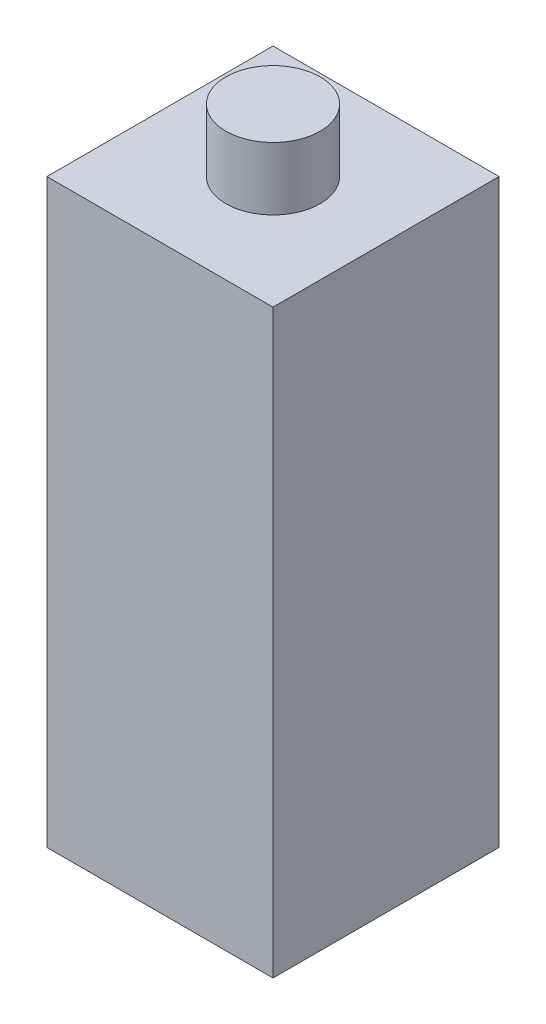
ISO-10303-21;
HEADER;
FILE_DESCRIPTION(('STEP AP214'),'2;1');
FILE_NAME('part.step','',(''),(''),'','','');
FILE_SCHEMA(('AUTOMOTIVE_DESIGN { 1 0 10303 214 1 1 1 1 }'));
ENDSEC;
DATA;
#1=APPLICATION_CONTEXT('core data for automotive mechanical design processes');
#2=APPLICATION_PROTOCOL_DEFINITION('international standard','automotive_design',2000,#1);
#3=PRODUCT_CONTEXT('',#1,'mechanical');
#4=PRODUCT('Part','Part','',(#3));
#5=PRODUCT_RELATED_PRODUCT_CATEGORY('part','',(#4));
#6=PRODUCT_DEFINITION_FORMATION('','',#4);
#7=PRODUCT_DEFINITION_CONTEXT('part definition',#1,'design');
#8=PRODUCT_DEFINITION('design','',#6,#7);
#9=PRODUCT_DEFINITION_SHAPE('','',#8);
#10=(LENGTH_UNIT() NAMED_UNIT(*) SI_UNIT(.MILLI.,.METRE.));
#11=(NAMED_UNIT(*) PLANE_ANGLE_UNIT() SI_UNIT($,.RADIAN.));
#12=(NAMED_UNIT(*) SI_UNIT($,.STERADIAN.) SOLID_ANGLE_UNIT());
#13=UNCERTAINTY_MEASURE_WITH_UNIT(LENGTH_MEASURE(1.E-05),#10,'distance_accuracy_value','');
#14=(GEOMETRIC_REPRESENTATION_CONTEXT(3) GLOBAL_UNCERTAINTY_ASSIGNED_CONTEXT((#13)) GLOBAL_UNIT_ASSIGNED_CONTEXT((#10,
#11,#12)) REPRESENTATION_CONTEXT('',''));
#15=CARTESIAN_POINT('',(0.,0.,0.));
#16=DIRECTION('',(0.,0.,1.));
#17=DIRECTION('',(1.,0.,0.));
#18=AXIS2_PLACEMENT_3D('',#15,#16,#17);
#19=CARTESIAN_POINT('',(36.,185.,-36.));
#20=DIRECTION('',(-1.,0.,0.));
#21=DIRECTION('',(0.,0.,1.));
#22=AXIS2_PLACEMENT_3D('',#19,#20,#21);
#23=PLANE('',#22);
#24=DIRECTION('',(0.,0.,-1.));
#25=VECTOR('',#24,1.);
#26=CARTESIAN_POINT('',(36.,0.,-36.));
#27=LINE('',#26,#25);
#28=CARTESIAN_POINT('',(36.,0.,36.));
#29=VERTEX_POINT('',#28);
#30=CARTESIAN_POINT('',(36.,0.,-36.));
#31=VERTEX_POINT('',#30);
#32=EDGE_CURVE('E112',#29,#31,#27,.T.);
#33=ORIENTED_EDGE('',*,*,#32,.T.);
#34=DIRECTION('',(0.,-1.,0.));
#35=VECTOR('',#34,1.);
#36=CARTESIAN_POINT('',(36.,185.,-36.));
#37=LINE('',#36,#35);
#38=CARTESIAN_POINT('',(36.,185.,-36.));
#39=VERTEX_POINT('',#38);
#40=EDGE_CURVE('E49',#39,#31,#37,.T.);
#41=ORIENTED_EDGE('',*,*,#40,.F.);
#42=DIRECTION('',(0.,0.,-1.));
#43=VECTOR('',#42,1.);
#44=CARTESIAN_POINT('',(36.,185.,-36.));
#45=LINE('',#44,#43);
#46=CARTESIAN_POINT('',(36.,185.,36.));
#47=VERTEX_POINT('',#46);
#48=EDGE_CURVE('E94',#47,#39,#45,.T.);
#49=ORIENTED_EDGE('',*,*,#48,.F.);
#50=DIRECTION('',(0.,-1.,0.));
#51=VECTOR('',#50,1.);
#52=CARTESIAN_POINT('',(36.,185.,36.));
#53=LINE('',#52,#51);
#54=EDGE_CURVE('E108',#47,#29,#53,.T.);
#55=ORIENTED_EDGE('',*,*,#54,.T.);
#56=EDGE_LOOP('',(#33,#41,#49,#55));
#57=FACE_BOUND('',#56,.T.);
#58=ADVANCED_FACE('F39',(#57),#23,.F.);
#59=CARTESIAN_POINT('',(-36.,185.,-36.));
#60=DIRECTION('',(0.,0.,1.));
#61=DIRECTION('',(1.,0.,0.));
#62=AXIS2_PLACEMENT_3D('',#59,#60,#61);
#63=PLANE('',#62);
#64=DIRECTION('',(-1.,0.,0.));
#65=VECTOR('',#64,1.);
#66=CARTESIAN_POINT('',(-36.,0.,-36.));
#67=LINE('',#66,#65);
#68=CARTESIAN_POINT('',(-36.,0.,-36.));
#69=VERTEX_POINT('',#68);
#70=EDGE_CURVE('E100',#31,#69,#67,.T.);
#71=ORIENTED_EDGE('',*,*,#70,.T.);
#72=DIRECTION('',(0.,-1.,0.));
#73=VECTOR('',#72,1.);
#74=CARTESIAN_POINT('',(-36.,185.,-36.));
#75=LINE('',#74,#73);
#76=CARTESIAN_POINT('',(-36.,185.,-36.));
#77=VERTEX_POINT('',#76);
#78=EDGE_CURVE('E98',#77,#69,#75,.T.);
#79=ORIENTED_EDGE('',*,*,#78,.F.);
#80=DIRECTION('',(-1.,0.,0.));
#81=VECTOR('',#80,1.);
#82=CARTESIAN_POINT('',(-36.,185.,-36.));
#83=LINE('',#82,#81);
#84=EDGE_CURVE('E89',#39,#77,#83,.T.);
#85=ORIENTED_EDGE('',*,*,#84,.F.);
#86=ORIENTED_EDGE('',*,*,#40,.T.);
#87=EDGE_LOOP('',(#71,#79,#85,#86));
#88=FACE_BOUND('',#87,.T.);
#89=ADVANCED_FACE('F99',(#88),#63,.F.);
#90=CARTESIAN_POINT('',(-36.,185.,-36.));
#91=DIRECTION('',(1.,0.,0.));
#92=DIRECTION('',(0.,0.,-1.));
#93=AXIS2_PLACEMENT_3D('',#90,#91,#92);
#94=PLANE('',#93);
#95=DIRECTION('',(0.,0.,1.));
#96=VECTOR('',#95,1.);
#97=CARTESIAN_POINT('',(-36.,0.,-36.));
#98=LINE('',#97,#96);
#99=CARTESIAN_POINT('',(-36.,0.,36.));
#100=VERTEX_POINT('',#99);
#101=EDGE_CURVE('E75',#69,#100,#98,.T.);
#102=ORIENTED_EDGE('',*,*,#101,.T.);
#103=DIRECTION('',(0.,-1.,0.));
#104=VECTOR('',#103,1.);
#105=CARTESIAN_POINT('',(-36.,185.,36.));
#106=LINE('',#105,#104);
#107=CARTESIAN_POINT('',(-36.,185.,36.));
#108=VERTEX_POINT('',#107);
#109=EDGE_CURVE('E102',#108,#100,#106,.T.);
#110=ORIENTED_EDGE('',*,*,#109,.F.);
#111=DIRECTION('',(0.,0.,1.));
#112=VECTOR('',#111,1.);
#113=CARTESIAN_POINT('',(-36.,185.,-36.));
#114=LINE('',#113,#112);
#115=EDGE_CURVE('E92',#77,#108,#114,.T.);
#116=ORIENTED_EDGE('',*,*,#115,.F.);
#117=ORIENTED_EDGE('',*,*,#78,.T.);
#118=EDGE_LOOP('',(#102,#110,#116,#117));
#119=FACE_BOUND('',#118,.T.);
#120=ADVANCED_FACE('F104',(#119),#94,.F.);
#121=CARTESIAN_POINT('',(-36.,185.,36.));
#122=DIRECTION('',(0.,0.,-1.));
#123=DIRECTION('',(-1.,0.,0.));
#124=AXIS2_PLACEMENT_3D('',#121,#122,#123);
#125=PLANE('',#124);
#126=DIRECTION('',(1.,0.,0.));
#127=VECTOR('',#126,1.);
#128=CARTESIAN_POINT('',(-36.,0.,36.));
#129=LINE('',#128,#127);
#130=EDGE_CURVE('E81',#100,#29,#129,.T.);
#131=ORIENTED_EDGE('',*,*,#130,.T.);
#132=ORIENTED_EDGE('',*,*,#54,.F.);
#133=DIRECTION('',(1.,0.,0.));
#134=VECTOR('',#133,1.);
#135=CARTESIAN_POINT('',(-36.,185.,36.));
#136=LINE('',#135,#134);
#137=EDGE_CURVE('E58',#108,#47,#136,.T.);
#138=ORIENTED_EDGE('',*,*,#137,.F.);
#139=ORIENTED_EDGE('',*,*,#109,.T.);
#140=EDGE_LOOP('',(#131,#132,#138,#139));
#141=FACE_BOUND('',#140,.T.);
#142=ADVANCED_FACE('F141',(#141),#125,.F.);
#143=CARTESIAN_POINT('',(0.,185.,0.));
#144=DIRECTION('',(0.,1.,0.));
#145=DIRECTION('',(0.,0.,1.));
#146=AXIS2_PLACEMENT_3D('',#143,#144,#145);
#147=PLANE('',#146);
#148=CARTESIAN_POINT('',(0.,185.,0.));
#149=DIRECTION('',(0.,1.,0.));
#150=DIRECTION('',(0.,0.,1.));
#151=AXIS2_PLACEMENT_3D('',#148,#149,#150);
#152=CIRCLE('',#151,15.);
#153=CARTESIAN_POINT('',(0.,185.,15.));
#154=VERTEX_POINT('',#153);
#155=EDGE_CURVE('E11',#154,#154,#152,.T.);
#156=ORIENTED_EDGE('',*,*,#155,.F.);
#157=EDGE_LOOP('',(#156));
#158=FACE_BOUND('',#157,.T.);
#159=ORIENTED_EDGE('',*,*,#48,.T.);
#160=ORIENTED_EDGE('',*,*,#84,.T.);
#161=ORIENTED_EDGE('',*,*,#115,.T.);
#162=ORIENTED_EDGE('',*,*,#137,.T.);
#163=EDGE_LOOP('',(#159,#160,#161,#162));
#164=FACE_BOUND('',#163,.T.);
#165=ADVANCED_FACE('F90',(#158,#164),#147,.T.);
#166=CARTESIAN_POINT('',(0.,0.,0.));
#167=DIRECTION('',(0.,1.,0.));
#168=DIRECTION('',(0.,0.,1.));
#169=AXIS2_PLACEMENT_3D('',#166,#167,#168);
#170=PLANE('',#169);
#171=CARTESIAN_POINT('',(0.,0.,0.));
#172=DIRECTION('',(0.,1.,0.));
#173=DIRECTION('',(0.,0.,1.));
#174=AXIS2_PLACEMENT_3D('',#171,#172,#173);
#175=CIRCLE('',#174,15.);
#176=CARTESIAN_POINT('',(0.,0.,15.));
#177=VERTEX_POINT('',#176);
#178=EDGE_CURVE('E42',#177,#177,#175,.T.);
#179=ORIENTED_EDGE('',*,*,#178,.T.);
#180=EDGE_LOOP('',(#179));
#181=FACE_BOUND('',#180,.T.);
#182=ORIENTED_EDGE('',*,*,#32,.F.);
#183=ORIENTED_EDGE('',*,*,#130,.F.);
#184=ORIENTED_EDGE('',*,*,#101,.F.);
#185=ORIENTED_EDGE('',*,*,#70,.F.);
#186=EDGE_LOOP('',(#182,#183,#184,#185));
#187=FACE_BOUND('',#186,.T.);
#188=ADVANCED_FACE('F129',(#181,#187),#170,.F.);
#189=CARTESIAN_POINT('',(0.,-20.,0.));
#190=DIRECTION('',(0.,1.,0.));
#191=DIRECTION('',(0.,0.,1.));
#192=AXIS2_PLACEMENT_3D('',#189,#190,#191);
#193=PLANE('',#192);
#194=CARTESIAN_POINT('',(0.,-20.,0.));
#195=DIRECTION('',(0.,1.,0.));
#196=DIRECTION('',(0.,0.,1.));
#197=AXIS2_PLACEMENT_3D('',#194,#195,#196);
#198=CIRCLE('',#197,15.);
#199=CARTESIAN_POINT('',(0.,-20.,15.));
#200=VERTEX_POINT('',#199);
#201=EDGE_CURVE('E210',#200,#200,#198,.T.);
#202=ORIENTED_EDGE('',*,*,#201,.F.);
#203=EDGE_LOOP('',(#202));
#204=FACE_BOUND('',#203,.T.);
#205=ADVANCED_FACE('F131',(#204),#193,.F.);
#206=CARTESIAN_POINT('',(0.,-20.,0.));
#207=DIRECTION('',(0.,1.,0.));
#208=DIRECTION('',(0.,0.,1.));
#209=AXIS2_PLACEMENT_3D('',#206,#207,#208);
#210=CYLINDRICAL_SURFACE('',#209,15.);
#211=ORIENTED_EDGE('',*,*,#201,.T.);
#212=EDGE_LOOP('',(#211));
#213=FACE_BOUND('',#212,.T.);
#214=ORIENTED_EDGE('',*,*,#178,.F.);
#215=EDGE_LOOP('',(#214));
#216=FACE_BOUND('',#215,.T.);
#217=ADVANCED_FACE('F138',(#213,#216),#210,.T.);
#218=ORIENTED_EDGE('',*,*,#155,.T.);
#219=EDGE_LOOP('',(#218));
#220=FACE_BOUND('',#219,.T.);
#221=CARTESIAN_POINT('',(0.,205.,0.));
#222=DIRECTION('',(0.,1.,0.));
#223=DIRECTION('',(0.,0.,1.));
#224=AXIS2_PLACEMENT_3D('',#221,#222,#223);
#225=CIRCLE('',#224,15.);
#226=CARTESIAN_POINT('',(0.,205.,15.));
#227=VERTEX_POINT('',#226);
#228=EDGE_CURVE('E207',#227,#227,#225,.T.);
#229=ORIENTED_EDGE('',*,*,#228,.F.);
#230=EDGE_LOOP('',(#229));
#231=FACE_BOUND('',#230,.T.);
#232=ADVANCED_FACE('F182',(#220,#231),#210,.T.);
#233=CARTESIAN_POINT('',(0.,205.,0.));
#234=DIRECTION('',(0.,1.,0.));
#235=DIRECTION('',(0.,0.,1.));
#236=AXIS2_PLACEMENT_3D('',#233,#234,#235);
#237=PLANE('',#236);
#238=ORIENTED_EDGE('',*,*,#228,.T.);
#239=EDGE_LOOP('',(#238));
#240=FACE_BOUND('',#239,.T.);
#241=ADVANCED_FACE('F192',(#240),#237,.T.);
#242=CLOSED_SHELL('',(#58,#89,#120,#142,#165,#188,#205,#217,#232,#241));
#243=MANIFOLD_SOLID_BREP('B2',#242);
#244=ADVANCED_BREP_SHAPE_REPRESENTATION('',(#18,#243),#14);
#245=SHAPE_DEFINITION_REPRESENTATION(#9,#244);
ENDSEC;
END-ISO-10303-21;
